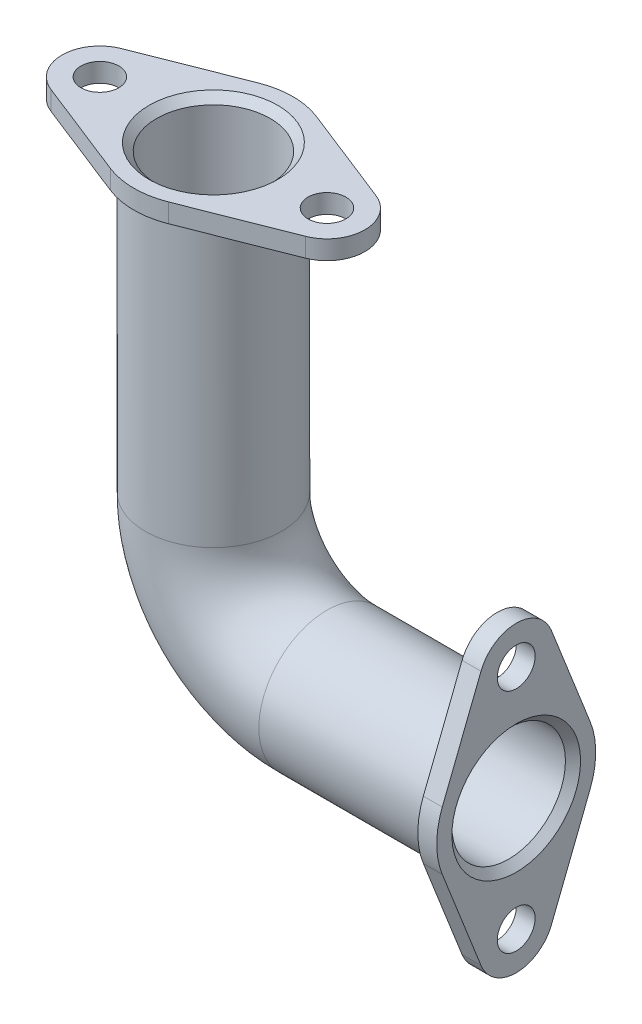
ISO-10303-21;
HEADER;
FILE_DESCRIPTION(('STEP AP214'),'2;1');
FILE_NAME('part.step','',(''),(''),'','','');
FILE_SCHEMA(('AUTOMOTIVE_DESIGN { 1 0 10303 214 1 1 1 1 }'));
ENDSEC;
DATA;
#1=APPLICATION_CONTEXT('core data for automotive mechanical design processes');
#2=APPLICATION_PROTOCOL_DEFINITION('international standard','automotive_design',2000,#1);
#3=PRODUCT_CONTEXT('',#1,'mechanical');
#4=PRODUCT('Part','Part','',(#3));
#5=PRODUCT_RELATED_PRODUCT_CATEGORY('part','',(#4));
#6=PRODUCT_DEFINITION_FORMATION('','',#4);
#7=PRODUCT_DEFINITION_CONTEXT('part definition',#1,'design');
#8=PRODUCT_DEFINITION('design','',#6,#7);
#9=PRODUCT_DEFINITION_SHAPE('','',#8);
#10=(LENGTH_UNIT() NAMED_UNIT(*) SI_UNIT(.MILLI.,.METRE.));
#11=(NAMED_UNIT(*) PLANE_ANGLE_UNIT() SI_UNIT($,.RADIAN.));
#12=(NAMED_UNIT(*) SI_UNIT($,.STERADIAN.) SOLID_ANGLE_UNIT());
#13=UNCERTAINTY_MEASURE_WITH_UNIT(LENGTH_MEASURE(1.E-05),#10,'distance_accuracy_value','');
#14=(GEOMETRIC_REPRESENTATION_CONTEXT(3) GLOBAL_UNCERTAINTY_ASSIGNED_CONTEXT((#13)) GLOBAL_UNIT_ASSIGNED_CONTEXT((#10,
#11,#12)) REPRESENTATION_CONTEXT('',''));
#15=CARTESIAN_POINT('',(0.,0.,0.));
#16=DIRECTION('',(0.,0.,1.));
#17=DIRECTION('',(1.,0.,0.));
#18=AXIS2_PLACEMENT_3D('',#15,#16,#17);
#19=CARTESIAN_POINT('',(150.,0.,0.));
#20=DIRECTION('',(-1.,0.,0.));
#21=DIRECTION('',(0.,-1.,0.));
#22=AXIS2_PLACEMENT_3D('',#19,#20,#21);
#23=CYLINDRICAL_SURFACE('',#22,36.);
#24=CARTESIAN_POINT('',(60.,0.,0.));
#25=DIRECTION('',(1.,0.,0.));
#26=DIRECTION('',(0.,0.,-1.));
#27=AXIS2_PLACEMENT_3D('',#24,#25,#26);
#28=CIRCLE('',#27,36.);
#29=CARTESIAN_POINT('',(60.,-36.,0.));
#30=VERTEX_POINT('',#29);
#31=EDGE_CURVE('E207',#30,#30,#28,.T.);
#32=ORIENTED_EDGE('',*,*,#31,.T.);
#33=EDGE_LOOP('',(#32));
#34=FACE_BOUND('',#33,.T.);
#35=CARTESIAN_POINT('',(150.,0.,0.));
#36=DIRECTION('',(1.,0.,0.));
#37=DIRECTION('',(0.,0.,-1.));
#38=AXIS2_PLACEMENT_3D('',#35,#36,#37);
#39=CIRCLE('',#38,36.);
#40=CARTESIAN_POINT('',(150.,0.,-36.));
#41=VERTEX_POINT('',#40);
#42=EDGE_CURVE('E203',#41,#41,#39,.T.);
#43=ORIENTED_EDGE('',*,*,#42,.F.);
#44=EDGE_LOOP('',(#43));
#45=FACE_BOUND('',#44,.T.);
#46=ADVANCED_FACE('F41',(#34,#45),#23,.T.);
#47=CARTESIAN_POINT('',(60.,60.,0.));
#48=DIRECTION('',(0.,0.,-1.));
#49=DIRECTION('',(-1.,0.,0.));
#50=AXIS2_PLACEMENT_3D('',#47,#48,#49);
#51=TOROIDAL_SURFACE('',#50,60.,36.);
#52=CARTESIAN_POINT('',(0.,60.,0.));
#53=DIRECTION('',(0.,-1.,0.));
#54=DIRECTION('',(0.,0.,-1.));
#55=AXIS2_PLACEMENT_3D('',#52,#53,#54);
#56=CIRCLE('',#55,36.);
#57=CARTESIAN_POINT('',(-36.,60.,0.));
#58=VERTEX_POINT('',#57);
#59=EDGE_CURVE('E211',#58,#58,#56,.T.);
#60=CARTESIAN_POINT('',(60.,60.,0.));
#61=DIRECTION('',(0.,0.,-1.));
#62=DIRECTION('',(-1.,0.,0.));
#63=AXIS2_PLACEMENT_3D('',#60,#61,#62);
#64=CIRCLE('',#63,96.);
#65=EDGE_CURVE('',#30,#58,#64,.T.);
#66=ORIENTED_EDGE('',*,*,#31,.F.);
#67=ORIENTED_EDGE('',*,*,#59,.T.);
#68=ORIENTED_EDGE('',*,*,#65,.T.);
#69=ORIENTED_EDGE('',*,*,#65,.F.);
#70=EDGE_LOOP('',(#66,#68,#67,#69));
#71=FACE_BOUND('',#70,.T.);
#72=ADVANCED_FACE('F244',(#71),#51,.T.);
#73=CARTESIAN_POINT('',(0.,60.,0.));
#74=DIRECTION('',(0.,1.,0.));
#75=DIRECTION('',(-1.,0.,0.));
#76=AXIS2_PLACEMENT_3D('',#73,#74,#75);
#77=CYLINDRICAL_SURFACE('',#76,36.);
#78=CARTESIAN_POINT('',(0.,210.,0.));
#79=DIRECTION('',(0.,-1.,0.));
#80=DIRECTION('',(0.,0.,-1.));
#81=AXIS2_PLACEMENT_3D('',#78,#79,#80);
#82=CIRCLE('',#81,36.);
#83=CARTESIAN_POINT('',(0.,210.,-36.));
#84=VERTEX_POINT('',#83);
#85=EDGE_CURVE('E194',#84,#84,#82,.T.);
#86=ORIENTED_EDGE('',*,*,#85,.T.);
#87=EDGE_LOOP('',(#86));
#88=FACE_BOUND('',#87,.T.);
#89=ORIENTED_EDGE('',*,*,#59,.F.);
#90=EDGE_LOOP('',(#89));
#91=FACE_BOUND('',#90,.T.);
#92=ADVANCED_FACE('F241',(#88,#91),#77,.T.);
#93=CARTESIAN_POINT('',(150.,0.,0.));
#94=DIRECTION('',(-1.,0.,0.));
#95=DIRECTION('',(0.,-1.,0.));
#96=AXIS2_PLACEMENT_3D('',#93,#94,#95);
#97=CYLINDRICAL_SURFACE('',#96,30.);
#98=CARTESIAN_POINT('',(156.,0.,0.));
#99=DIRECTION('',(1.,0.,0.));
#100=DIRECTION('',(0.,1.,0.));
#101=AXIS2_PLACEMENT_3D('',#98,#99,#100);
#102=CIRCLE('',#101,30.);
#103=CARTESIAN_POINT('',(156.,30.,0.));
#104=VERTEX_POINT('',#103);
#105=EDGE_CURVE('E215',#104,#104,#102,.T.);
#106=ORIENTED_EDGE('',*,*,#105,.T.);
#107=EDGE_LOOP('',(#106));
#108=FACE_BOUND('',#107,.T.);
#109=CARTESIAN_POINT('',(60.,0.,0.));
#110=DIRECTION('',(-1.,0.,0.));
#111=DIRECTION('',(0.,-1.,0.));
#112=AXIS2_PLACEMENT_3D('',#109,#110,#111);
#113=CIRCLE('',#112,30.);
#114=CARTESIAN_POINT('',(60.,-30.,0.));
#115=VERTEX_POINT('',#114);
#116=EDGE_CURVE('E195',#115,#115,#113,.F.);
#117=ORIENTED_EDGE('',*,*,#116,.F.);
#118=EDGE_LOOP('',(#117));
#119=FACE_BOUND('',#118,.T.);
#120=ADVANCED_FACE('F243',(#108,#119),#97,.F.);
#121=CARTESIAN_POINT('',(60.,60.,0.));
#122=DIRECTION('',(0.,0.,-1.));
#123=DIRECTION('',(-1.,0.,0.));
#124=AXIS2_PLACEMENT_3D('',#121,#122,#123);
#125=TOROIDAL_SURFACE('',#124,60.,30.);
#126=CARTESIAN_POINT('',(0.,60.,0.));
#127=DIRECTION('',(0.,-1.,0.));
#128=DIRECTION('',(0.,0.,-1.));
#129=AXIS2_PLACEMENT_3D('',#126,#127,#128);
#130=CIRCLE('',#129,30.);
#131=CARTESIAN_POINT('',(-30.,60.,0.));
#132=VERTEX_POINT('',#131);
#133=EDGE_CURVE('E199',#132,#132,#130,.T.);
#134=CARTESIAN_POINT('',(60.,60.,0.));
#135=DIRECTION('',(0.,0.,-1.));
#136=DIRECTION('',(-1.,0.,0.));
#137=AXIS2_PLACEMENT_3D('',#134,#135,#136);
#138=CIRCLE('',#137,90.);
#139=EDGE_CURVE('',#115,#132,#138,.T.);
#140=ORIENTED_EDGE('',*,*,#116,.T.);
#141=ORIENTED_EDGE('',*,*,#133,.F.);
#142=ORIENTED_EDGE('',*,*,#139,.T.);
#143=ORIENTED_EDGE('',*,*,#139,.F.);
#144=EDGE_LOOP('',(#140,#142,#141,#143));
#145=FACE_BOUND('',#144,.T.);
#146=ADVANCED_FACE('F251',(#145),#125,.F.);
#147=CARTESIAN_POINT('',(0.,60.,0.));
#148=DIRECTION('',(0.,1.,0.));
#149=DIRECTION('',(-1.,0.,0.));
#150=AXIS2_PLACEMENT_3D('',#147,#148,#149);
#151=CYLINDRICAL_SURFACE('',#150,30.);
#152=CARTESIAN_POINT('',(0.,216.,0.));
#153=DIRECTION('',(0.,1.,0.));
#154=DIRECTION('',(-1.,0.,0.));
#155=AXIS2_PLACEMENT_3D('',#152,#153,#154);
#156=CIRCLE('',#155,30.);
#157=CARTESIAN_POINT('',(-30.,216.,0.));
#158=VERTEX_POINT('',#157);
#159=EDGE_CURVE('E51',#158,#158,#156,.T.);
#160=ORIENTED_EDGE('',*,*,#159,.T.);
#161=EDGE_LOOP('',(#160));
#162=FACE_BOUND('',#161,.T.);
#163=ORIENTED_EDGE('',*,*,#133,.T.);
#164=EDGE_LOOP('',(#163));
#165=FACE_BOUND('',#164,.T.);
#166=ADVANCED_FACE('F229',(#162,#165),#151,.F.);
#167=CARTESIAN_POINT('',(-60.,220.,0.));
#168=DIRECTION('',(0.,1.,0.));
#169=DIRECTION('',(-1.,0.,0.));
#170=AXIS2_PLACEMENT_3D('',#167,#168,#169);
#171=PLANE('',#170);
#172=CARTESIAN_POINT('',(0.,220.,0.));
#173=DIRECTION('',(0.,1.,0.));
#174=DIRECTION('',(-1.,0.,0.));
#175=AXIS2_PLACEMENT_3D('',#172,#173,#174);
#176=CIRCLE('',#175,34.);
#177=CARTESIAN_POINT('',(-34.,220.,0.));
#178=VERTEX_POINT('',#177);
#179=EDGE_CURVE('E11',#178,#178,#176,.F.);
#180=ORIENTED_EDGE('',*,*,#179,.T.);
#181=EDGE_LOOP('',(#180));
#182=FACE_BOUND('',#181,.T.);
#183=CARTESIAN_POINT('',(60.,220.,0.));
#184=DIRECTION('',(0.,1.,0.));
#185=DIRECTION('',(-1.,0.,0.));
#186=AXIS2_PLACEMENT_3D('',#183,#184,#185);
#187=CIRCLE('',#186,9.99999999999999);
#188=CARTESIAN_POINT('',(50.,220.,0.));
#189=VERTEX_POINT('',#188);
#190=EDGE_CURVE('E154',#189,#189,#187,.T.);
#191=ORIENTED_EDGE('',*,*,#190,.F.);
#192=EDGE_LOOP('',(#191));
#193=FACE_BOUND('',#192,.T.);
#194=CARTESIAN_POINT('',(-60.,220.,0.));
#195=DIRECTION('',(0.,1.,0.));
#196=DIRECTION('',(-1.,0.,0.));
#197=AXIS2_PLACEMENT_3D('',#194,#195,#196);
#198=CIRCLE('',#197,20.);
#199=CARTESIAN_POINT('',(-67.3333333333333,220.,-18.6070476492705));
#200=VERTEX_POINT('',#199);
#201=CARTESIAN_POINT('',(-67.3333333333333,220.,18.6070476492705));
#202=VERTEX_POINT('',#201);
#203=EDGE_CURVE('E172',#200,#202,#198,.T.);
#204=ORIENTED_EDGE('',*,*,#203,.T.);
#205=DIRECTION('',(0.930352382463524,0.,0.366666666666667));
#206=VECTOR('',#205,1.);
#207=CARTESIAN_POINT('',(-67.3333333333333,220.,18.6070476492705));
#208=LINE('',#207,#206);
#209=CARTESIAN_POINT('',(-15.4,220.,39.074800063468));
#210=VERTEX_POINT('',#209);
#211=EDGE_CURVE('E104',#202,#210,#208,.T.);
#212=ORIENTED_EDGE('',*,*,#211,.T.);
#213=CARTESIAN_POINT('',(0.,220.,0.));
#214=DIRECTION('',(0.,1.,0.));
#215=DIRECTION('',(-1.,0.,0.));
#216=AXIS2_PLACEMENT_3D('',#213,#214,#215);
#217=CIRCLE('',#216,42.);
#218=CARTESIAN_POINT('',(15.4,220.,39.074800063468));
#219=VERTEX_POINT('',#218);
#220=EDGE_CURVE('E491',#210,#219,#217,.T.);
#221=ORIENTED_EDGE('',*,*,#220,.T.);
#222=DIRECTION('',(0.930352382463524,0.,-0.366666666666667));
#223=VECTOR('',#222,1.);
#224=CARTESIAN_POINT('',(15.4,220.,39.074800063468));
#225=LINE('',#224,#223);
#226=CARTESIAN_POINT('',(67.3333333333333,220.,18.6070476492705));
#227=VERTEX_POINT('',#226);
#228=EDGE_CURVE('E494',#219,#227,#225,.T.);
#229=ORIENTED_EDGE('',*,*,#228,.T.);
#230=CARTESIAN_POINT('',(60.,220.,0.));
#231=DIRECTION('',(0.,1.,0.));
#232=DIRECTION('',(-1.,0.,0.));
#233=AXIS2_PLACEMENT_3D('',#230,#231,#232);
#234=CIRCLE('',#233,20.);
#235=CARTESIAN_POINT('',(67.3333333333333,220.,-18.6070476492705));
#236=VERTEX_POINT('',#235);
#237=EDGE_CURVE('E127',#227,#236,#234,.T.);
#238=ORIENTED_EDGE('',*,*,#237,.T.);
#239=DIRECTION('',(-0.930352382463524,0.,-0.366666666666667));
#240=VECTOR('',#239,1.);
#241=CARTESIAN_POINT('',(67.3333333333333,220.,-18.6070476492705));
#242=LINE('',#241,#240);
#243=CARTESIAN_POINT('',(15.4,220.,-39.074800063468));
#244=VERTEX_POINT('',#243);
#245=EDGE_CURVE('E120',#236,#244,#242,.T.);
#246=ORIENTED_EDGE('',*,*,#245,.T.);
#247=CARTESIAN_POINT('',(0.,220.,0.));
#248=DIRECTION('',(0.,1.,0.));
#249=DIRECTION('',(-1.,0.,0.));
#250=AXIS2_PLACEMENT_3D('',#247,#248,#249);
#251=CIRCLE('',#250,42.);
#252=CARTESIAN_POINT('',(-15.4,220.,-39.074800063468));
#253=VERTEX_POINT('',#252);
#254=EDGE_CURVE('E125',#244,#253,#251,.T.);
#255=ORIENTED_EDGE('',*,*,#254,.T.);
#256=DIRECTION('',(-0.930352382463524,0.,0.366666666666667));
#257=VECTOR('',#256,1.);
#258=CARTESIAN_POINT('',(-67.3333333333333,220.,-18.6070476492705));
#259=LINE('',#258,#257);
#260=EDGE_CURVE('E59',#253,#200,#259,.T.);
#261=ORIENTED_EDGE('',*,*,#260,.T.);
#262=EDGE_LOOP('',(#204,#212,#221,#229,#238,#246,#255,#261));
#263=FACE_BOUND('',#262,.T.);
#264=CARTESIAN_POINT('',(-60.,220.,0.));
#265=DIRECTION('',(0.,1.,0.));
#266=DIRECTION('',(-1.,0.,0.));
#267=AXIS2_PLACEMENT_3D('',#264,#265,#266);
#268=CIRCLE('',#267,9.99999999999999);
#269=CARTESIAN_POINT('',(-70.,220.,0.));
#270=VERTEX_POINT('',#269);
#271=EDGE_CURVE('E473',#270,#270,#268,.T.);
#272=ORIENTED_EDGE('',*,*,#271,.F.);
#273=EDGE_LOOP('',(#272));
#274=FACE_BOUND('',#273,.T.);
#275=ADVANCED_FACE('F122',(#182,#193,#263,#274),#171,.T.);
#276=CARTESIAN_POINT('',(-60.,210.,0.));
#277=DIRECTION('',(0.,1.,0.));
#278=DIRECTION('',(-1.,0.,0.));
#279=AXIS2_PLACEMENT_3D('',#276,#277,#278);
#280=PLANE('',#279);
#281=ORIENTED_EDGE('',*,*,#85,.F.);
#282=EDGE_LOOP('',(#281));
#283=FACE_BOUND('',#282,.T.);
#284=CARTESIAN_POINT('',(-60.,210.,0.));
#285=DIRECTION('',(0.,1.,0.));
#286=DIRECTION('',(-1.,0.,0.));
#287=AXIS2_PLACEMENT_3D('',#284,#285,#286);
#288=CIRCLE('',#287,20.);
#289=CARTESIAN_POINT('',(-67.3333333333333,210.,-18.6070476492705));
#290=VERTEX_POINT('',#289);
#291=CARTESIAN_POINT('',(-67.3333333333333,210.,18.6070476492705));
#292=VERTEX_POINT('',#291);
#293=EDGE_CURVE('E149',#290,#292,#288,.T.);
#294=ORIENTED_EDGE('',*,*,#293,.F.);
#295=DIRECTION('',(-0.930352382463524,0.,0.366666666666667));
#296=VECTOR('',#295,1.);
#297=CARTESIAN_POINT('',(-67.3333333333333,210.,-18.6070476492705));
#298=LINE('',#297,#296);
#299=CARTESIAN_POINT('',(-15.4,210.,-39.074800063468));
#300=VERTEX_POINT('',#299);
#301=EDGE_CURVE('E95',#300,#290,#298,.T.);
#302=ORIENTED_EDGE('',*,*,#301,.F.);
#303=CARTESIAN_POINT('',(0.,210.,0.));
#304=DIRECTION('',(0.,1.,0.));
#305=DIRECTION('',(-1.,0.,0.));
#306=AXIS2_PLACEMENT_3D('',#303,#304,#305);
#307=CIRCLE('',#306,42.);
#308=CARTESIAN_POINT('',(15.4,210.,-39.074800063468));
#309=VERTEX_POINT('',#308);
#310=EDGE_CURVE('E89',#309,#300,#307,.T.);
#311=ORIENTED_EDGE('',*,*,#310,.F.);
#312=DIRECTION('',(-0.930352382463524,0.,-0.366666666666667));
#313=VECTOR('',#312,1.);
#314=CARTESIAN_POINT('',(67.3333333333333,210.,-18.6070476492705));
#315=LINE('',#314,#313);
#316=CARTESIAN_POINT('',(67.3333333333333,210.,-18.6070476492705));
#317=VERTEX_POINT('',#316);
#318=EDGE_CURVE('E136',#317,#309,#315,.T.);
#319=ORIENTED_EDGE('',*,*,#318,.F.);
#320=CARTESIAN_POINT('',(60.,210.,0.));
#321=DIRECTION('',(0.,1.,0.));
#322=DIRECTION('',(-1.,0.,0.));
#323=AXIS2_PLACEMENT_3D('',#320,#321,#322);
#324=CIRCLE('',#323,20.);
#325=CARTESIAN_POINT('',(67.3333333333333,210.,18.6070476492705));
#326=VERTEX_POINT('',#325);
#327=EDGE_CURVE('E163',#326,#317,#324,.T.);
#328=ORIENTED_EDGE('',*,*,#327,.F.);
#329=DIRECTION('',(0.930352382463524,0.,-0.366666666666667));
#330=VECTOR('',#329,1.);
#331=CARTESIAN_POINT('',(15.4,210.,39.074800063468));
#332=LINE('',#331,#330);
#333=CARTESIAN_POINT('',(15.4,210.,39.074800063468));
#334=VERTEX_POINT('',#333);
#335=EDGE_CURVE('E160',#334,#326,#332,.T.);
#336=ORIENTED_EDGE('',*,*,#335,.F.);
#337=CARTESIAN_POINT('',(0.,210.,0.));
#338=DIRECTION('',(0.,1.,0.));
#339=DIRECTION('',(-1.,0.,0.));
#340=AXIS2_PLACEMENT_3D('',#337,#338,#339);
#341=CIRCLE('',#340,42.);
#342=CARTESIAN_POINT('',(-15.4,210.,39.074800063468));
#343=VERTEX_POINT('',#342);
#344=EDGE_CURVE('E157',#343,#334,#341,.T.);
#345=ORIENTED_EDGE('',*,*,#344,.F.);
#346=DIRECTION('',(0.930352382463524,0.,0.366666666666667));
#347=VECTOR('',#346,1.);
#348=CARTESIAN_POINT('',(-67.3333333333333,210.,18.6070476492705));
#349=LINE('',#348,#347);
#350=EDGE_CURVE('E153',#292,#343,#349,.T.);
#351=ORIENTED_EDGE('',*,*,#350,.F.);
#352=EDGE_LOOP('',(#294,#302,#311,#319,#328,#336,#345,#351));
#353=FACE_BOUND('',#352,.T.);
#354=CARTESIAN_POINT('',(60.,210.,0.));
#355=DIRECTION('',(0.,1.,0.));
#356=DIRECTION('',(-1.,0.,0.));
#357=AXIS2_PLACEMENT_3D('',#354,#355,#356);
#358=CIRCLE('',#357,9.99999999999999);
#359=CARTESIAN_POINT('',(50.,210.,0.));
#360=VERTEX_POINT('',#359);
#361=EDGE_CURVE('E477',#360,#360,#358,.T.);
#362=ORIENTED_EDGE('',*,*,#361,.T.);
#363=EDGE_LOOP('',(#362));
#364=FACE_BOUND('',#363,.T.);
#365=CARTESIAN_POINT('',(-60.,210.,0.));
#366=DIRECTION('',(0.,1.,0.));
#367=DIRECTION('',(-1.,0.,0.));
#368=AXIS2_PLACEMENT_3D('',#365,#366,#367);
#369=CIRCLE('',#368,9.99999999999999);
#370=CARTESIAN_POINT('',(-70.,210.,0.));
#371=VERTEX_POINT('',#370);
#372=EDGE_CURVE('E472',#371,#371,#369,.T.);
#373=ORIENTED_EDGE('',*,*,#372,.T.);
#374=EDGE_LOOP('',(#373));
#375=FACE_BOUND('',#374,.T.);
#376=ADVANCED_FACE('F270',(#283,#353,#364,#375),#280,.F.);
#377=CARTESIAN_POINT('',(-60.,220.,0.));
#378=DIRECTION('',(0.,-1.,0.));
#379=DIRECTION('',(1.,0.,0.));
#380=AXIS2_PLACEMENT_3D('',#377,#378,#379);
#381=CYLINDRICAL_SURFACE('',#380,20.);
#382=ORIENTED_EDGE('',*,*,#293,.T.);
#383=DIRECTION('',(0.,-1.,0.));
#384=VECTOR('',#383,1.);
#385=CARTESIAN_POINT('',(-67.3333333333333,220.,18.6070476492705));
#386=LINE('',#385,#384);
#387=EDGE_CURVE('E191',#202,#292,#386,.T.);
#388=ORIENTED_EDGE('',*,*,#387,.F.);
#389=ORIENTED_EDGE('',*,*,#203,.F.);
#390=DIRECTION('',(0.,-1.,0.));
#391=VECTOR('',#390,1.);
#392=CARTESIAN_POINT('',(-67.3333333333333,220.,-18.6070476492705));
#393=LINE('',#392,#391);
#394=EDGE_CURVE('E145',#200,#290,#393,.T.);
#395=ORIENTED_EDGE('',*,*,#394,.T.);
#396=EDGE_LOOP('',(#382,#388,#389,#395));
#397=FACE_BOUND('',#396,.T.);
#398=ADVANCED_FACE('F266',(#397),#381,.T.);
#399=CARTESIAN_POINT('',(-67.3333333333333,220.,18.6070476492705));
#400=DIRECTION('',(0.366666666666667,0.,-0.930352382463524));
#401=DIRECTION('',(-0.930352382463524,0.,-0.366666666666667));
#402=AXIS2_PLACEMENT_3D('',#399,#400,#401);
#403=PLANE('',#402);
#404=ORIENTED_EDGE('',*,*,#350,.T.);
#405=DIRECTION('',(0.,-1.,0.));
#406=VECTOR('',#405,1.);
#407=CARTESIAN_POINT('',(-15.4,220.,39.074800063468));
#408=LINE('',#407,#406);
#409=EDGE_CURVE('E187',#210,#343,#408,.T.);
#410=ORIENTED_EDGE('',*,*,#409,.F.);
#411=ORIENTED_EDGE('',*,*,#211,.F.);
#412=ORIENTED_EDGE('',*,*,#387,.T.);
#413=EDGE_LOOP('',(#404,#410,#411,#412));
#414=FACE_BOUND('',#413,.T.);
#415=ADVANCED_FACE('F269',(#414),#403,.F.);
#416=CARTESIAN_POINT('',(0.,220.,0.));
#417=DIRECTION('',(0.,-1.,0.));
#418=DIRECTION('',(1.,0.,0.));
#419=AXIS2_PLACEMENT_3D('',#416,#417,#418);
#420=CYLINDRICAL_SURFACE('',#419,42.);
#421=ORIENTED_EDGE('',*,*,#344,.T.);
#422=DIRECTION('',(0.,-1.,0.));
#423=VECTOR('',#422,1.);
#424=CARTESIAN_POINT('',(15.4,220.,39.074800063468));
#425=LINE('',#424,#423);
#426=EDGE_CURVE('E183',#219,#334,#425,.T.);
#427=ORIENTED_EDGE('',*,*,#426,.F.);
#428=ORIENTED_EDGE('',*,*,#220,.F.);
#429=ORIENTED_EDGE('',*,*,#409,.T.);
#430=EDGE_LOOP('',(#421,#427,#428,#429));
#431=FACE_BOUND('',#430,.T.);
#432=ADVANCED_FACE('F274',(#431),#420,.T.);
#433=CARTESIAN_POINT('',(15.4,220.,39.074800063468));
#434=DIRECTION('',(-0.366666666666667,0.,-0.930352382463524));
#435=DIRECTION('',(-0.930352382463524,0.,0.366666666666667));
#436=AXIS2_PLACEMENT_3D('',#433,#434,#435);
#437=PLANE('',#436);
#438=ORIENTED_EDGE('',*,*,#335,.T.);
#439=DIRECTION('',(0.,-1.,0.));
#440=VECTOR('',#439,1.);
#441=CARTESIAN_POINT('',(67.3333333333333,220.,18.6070476492705));
#442=LINE('',#441,#440);
#443=EDGE_CURVE('E179',#227,#326,#442,.T.);
#444=ORIENTED_EDGE('',*,*,#443,.F.);
#445=ORIENTED_EDGE('',*,*,#228,.F.);
#446=ORIENTED_EDGE('',*,*,#426,.T.);
#447=EDGE_LOOP('',(#438,#444,#445,#446));
#448=FACE_BOUND('',#447,.T.);
#449=ADVANCED_FACE('F277',(#448),#437,.F.);
#450=CARTESIAN_POINT('',(60.,220.,0.));
#451=DIRECTION('',(0.,-1.,0.));
#452=DIRECTION('',(1.,0.,0.));
#453=AXIS2_PLACEMENT_3D('',#450,#451,#452);
#454=CYLINDRICAL_SURFACE('',#453,20.);
#455=ORIENTED_EDGE('',*,*,#327,.T.);
#456=DIRECTION('',(0.,-1.,0.));
#457=VECTOR('',#456,1.);
#458=CARTESIAN_POINT('',(67.3333333333333,220.,-18.6070476492705));
#459=LINE('',#458,#457);
#460=EDGE_CURVE('E138',#236,#317,#459,.T.);
#461=ORIENTED_EDGE('',*,*,#460,.F.);
#462=ORIENTED_EDGE('',*,*,#237,.F.);
#463=ORIENTED_EDGE('',*,*,#443,.T.);
#464=EDGE_LOOP('',(#455,#461,#462,#463));
#465=FACE_BOUND('',#464,.T.);
#466=ADVANCED_FACE('F281',(#465),#454,.T.);
#467=CARTESIAN_POINT('',(67.3333333333333,220.,-18.6070476492705));
#468=DIRECTION('',(-0.366666666666667,0.,0.930352382463524));
#469=DIRECTION('',(0.930352382463524,0.,0.366666666666667));
#470=AXIS2_PLACEMENT_3D('',#467,#468,#469);
#471=PLANE('',#470);
#472=ORIENTED_EDGE('',*,*,#318,.T.);
#473=DIRECTION('',(0.,-1.,0.));
#474=VECTOR('',#473,1.);
#475=CARTESIAN_POINT('',(15.4,220.,-39.074800063468));
#476=LINE('',#475,#474);
#477=EDGE_CURVE('E133',#244,#309,#476,.T.);
#478=ORIENTED_EDGE('',*,*,#477,.F.);
#479=ORIENTED_EDGE('',*,*,#245,.F.);
#480=ORIENTED_EDGE('',*,*,#460,.T.);
#481=EDGE_LOOP('',(#472,#478,#479,#480));
#482=FACE_BOUND('',#481,.T.);
#483=ADVANCED_FACE('F134',(#482),#471,.F.);
#484=CARTESIAN_POINT('',(0.,220.,0.));
#485=DIRECTION('',(0.,-1.,0.));
#486=DIRECTION('',(1.,0.,0.));
#487=AXIS2_PLACEMENT_3D('',#484,#485,#486);
#488=CYLINDRICAL_SURFACE('',#487,42.);
#489=ORIENTED_EDGE('',*,*,#310,.T.);
#490=DIRECTION('',(0.,-1.,0.));
#491=VECTOR('',#490,1.);
#492=CARTESIAN_POINT('',(-15.4,220.,-39.074800063468));
#493=LINE('',#492,#491);
#494=EDGE_CURVE('E139',#253,#300,#493,.T.);
#495=ORIENTED_EDGE('',*,*,#494,.F.);
#496=ORIENTED_EDGE('',*,*,#254,.F.);
#497=ORIENTED_EDGE('',*,*,#477,.T.);
#498=EDGE_LOOP('',(#489,#495,#496,#497));
#499=FACE_BOUND('',#498,.T.);
#500=ADVANCED_FACE('F141',(#499),#488,.T.);
#501=CARTESIAN_POINT('',(-67.3333333333333,220.,-18.6070476492705));
#502=DIRECTION('',(0.366666666666667,0.,0.930352382463524));
#503=DIRECTION('',(0.930352382463524,0.,-0.366666666666667));
#504=AXIS2_PLACEMENT_3D('',#501,#502,#503);
#505=PLANE('',#504);
#506=ORIENTED_EDGE('',*,*,#301,.T.);
#507=ORIENTED_EDGE('',*,*,#394,.F.);
#508=ORIENTED_EDGE('',*,*,#260,.F.);
#509=ORIENTED_EDGE('',*,*,#494,.T.);
#510=EDGE_LOOP('',(#506,#507,#508,#509));
#511=FACE_BOUND('',#510,.T.);
#512=ADVANCED_FACE('F290',(#511),#505,.F.);
#513=CARTESIAN_POINT('',(60.,220.,0.));
#514=DIRECTION('',(0.,-1.,0.));
#515=DIRECTION('',(1.,0.,0.));
#516=AXIS2_PLACEMENT_3D('',#513,#514,#515);
#517=CYLINDRICAL_SURFACE('',#516,9.99999999999999);
#518=ORIENTED_EDGE('',*,*,#190,.T.);
#519=EDGE_LOOP('',(#518));
#520=FACE_BOUND('',#519,.T.);
#521=ORIENTED_EDGE('',*,*,#361,.F.);
#522=EDGE_LOOP('',(#521));
#523=FACE_BOUND('',#522,.T.);
#524=ADVANCED_FACE('F293',(#520,#523),#517,.F.);
#525=CARTESIAN_POINT('',(-60.,220.,0.));
#526=DIRECTION('',(0.,-1.,0.));
#527=DIRECTION('',(1.,0.,0.));
#528=AXIS2_PLACEMENT_3D('',#525,#526,#527);
#529=CYLINDRICAL_SURFACE('',#528,9.99999999999999);
#530=ORIENTED_EDGE('',*,*,#271,.T.);
#531=EDGE_LOOP('',(#530));
#532=FACE_BOUND('',#531,.T.);
#533=ORIENTED_EDGE('',*,*,#372,.F.);
#534=EDGE_LOOP('',(#533));
#535=FACE_BOUND('',#534,.T.);
#536=ADVANCED_FACE('F302',(#532,#535),#529,.F.);
#537=CARTESIAN_POINT('',(160.,59.9999999999595,6.96738850780587E-05));
#538=DIRECTION('',(1.,0.,0.));
#539=DIRECTION('',(0.,0.,-1.));
#540=AXIS2_PLACEMENT_3D('',#537,#538,#539);
#541=PLANE('',#540);
#542=CARTESIAN_POINT('',(160.,0.,0.));
#543=DIRECTION('',(1.,0.,0.));
#544=DIRECTION('',(0.,0.,-1.));
#545=AXIS2_PLACEMENT_3D('',#542,#543,#544);
#546=CIRCLE('',#545,34.0000000000001);
#547=CARTESIAN_POINT('',(160.,0.,-34.0000000000001));
#548=VERTEX_POINT('',#547);
#549=EDGE_CURVE('E222',#548,#548,#546,.F.);
#550=ORIENTED_EDGE('',*,*,#549,.T.);
#551=EDGE_LOOP('',(#550));
#552=FACE_BOUND('',#551,.T.);
#553=CARTESIAN_POINT('',(160.,-60.,-2.21819090873154E-11));
#554=DIRECTION('',(1.,0.,0.));
#555=DIRECTION('',(0.,0.,-1.));
#556=AXIS2_PLACEMENT_3D('',#553,#554,#555);
#557=CIRCLE('',#556,9.99999999997879);
#558=CARTESIAN_POINT('',(160.,-60.,-10.000000000001));
#559=VERTEX_POINT('',#558);
#560=EDGE_CURVE('E369',#559,#559,#557,.T.);
#561=ORIENTED_EDGE('',*,*,#560,.F.);
#562=EDGE_LOOP('',(#561));
#563=FACE_BOUND('',#562,.T.);
#564=CARTESIAN_POINT('',(160.,59.9999999999595,6.96738850780587E-05));
#565=DIRECTION('',(1.,0.,0.));
#566=DIRECTION('',(0.,0.,-1.));
#567=AXIS2_PLACEMENT_3D('',#564,#565,#566);
#568=CIRCLE('',#567,20.);
#569=CARTESIAN_POINT('',(160.,67.3333549403763,-18.6069694596758));
#570=VERTEX_POINT('',#569);
#571=CARTESIAN_POINT('',(160.,67.3333117261996,18.6071258388401));
#572=VERTEX_POINT('',#571);
#573=EDGE_CURVE('E377',#570,#572,#568,.T.);
#574=ORIENTED_EDGE('',*,*,#573,.T.);
#575=DIRECTION('',(0.,-0.93035280824775,0.366665586312003));
#576=VECTOR('',#575,1.);
#577=CARTESIAN_POINT('',(160.,67.3333117261996,18.6071258388401));
#578=LINE('',#577,#576);
#579=CARTESIAN_POINT('',(160.,15.3999546251041,39.0748179464055));
#580=VERTEX_POINT('',#579);
#581=EDGE_CURVE('E381',#572,#580,#578,.T.);
#582=ORIENTED_EDGE('',*,*,#581,.T.);
#583=CARTESIAN_POINT('',(160.,0.,0.));
#584=DIRECTION('',(1.,0.,0.));
#585=DIRECTION('',(0.,0.,-1.));
#586=AXIS2_PLACEMENT_3D('',#583,#584,#585);
#587=CIRCLE('',#586,42.);
#588=CARTESIAN_POINT('',(160.,-15.4000000000144,39.0748000634623));
#589=VERTEX_POINT('',#588);
#590=EDGE_CURVE('E386',#580,#589,#587,.T.);
#591=ORIENTED_EDGE('',*,*,#590,.T.);
#592=DIRECTION('',(0.,-0.930352382463389,-0.366666666667011));
#593=VECTOR('',#592,1.);
#594=CARTESIAN_POINT('',(160.,-67.3333333333402,18.6070476492456));
#595=LINE('',#594,#593);
#596=CARTESIAN_POINT('',(160.,-67.3333333333402,18.6070476492456));
#597=VERTEX_POINT('',#596);
#598=EDGE_CURVE('E390',#589,#597,#595,.T.);
#599=ORIENTED_EDGE('',*,*,#598,.T.);
#600=CARTESIAN_POINT('',(160.,-60.,-2.21819090873154E-11));
#601=DIRECTION('',(1.,0.,0.));
#602=DIRECTION('',(0.,0.,-1.));
#603=AXIS2_PLACEMENT_3D('',#600,#601,#602);
#604=CIRCLE('',#603,20.);
#605=CARTESIAN_POINT('',(160.,-67.3333333333265,-18.6070476492953));
#606=VERTEX_POINT('',#605);
#607=EDGE_CURVE('E394',#597,#606,#604,.T.);
#608=ORIENTED_EDGE('',*,*,#607,.T.);
#609=DIRECTION('',(0.,0.930352382463659,-0.366666666666323));
#610=VECTOR('',#609,1.);
#611=CARTESIAN_POINT('',(160.,-67.3333333333265,-18.6070476492953));
#612=LINE('',#611,#610);
#613=CARTESIAN_POINT('',(160.,-15.3999999999855,-39.0748000634737));
#614=VERTEX_POINT('',#613);
#615=EDGE_CURVE('E398',#606,#614,#612,.T.);
#616=ORIENTED_EDGE('',*,*,#615,.T.);
#617=CARTESIAN_POINT('',(160.,0.,0.));
#618=DIRECTION('',(1.,0.,0.));
#619=DIRECTION('',(0.,0.,-1.));
#620=AXIS2_PLACEMENT_3D('',#617,#618,#619);
#621=CIRCLE('',#620,42.);
#622=CARTESIAN_POINT('',(160.,15.4000453748751,-39.0747821804778));
#623=VERTEX_POINT('',#622);
#624=EDGE_CURVE('E402',#614,#623,#621,.T.);
#625=ORIENTED_EDGE('',*,*,#624,.T.);
#626=DIRECTION('',(0.,0.930351956678044,0.366667747020836));
#627=VECTOR('',#626,1.);
#628=CARTESIAN_POINT('',(160.,67.3333549403763,-18.6069694596758));
#629=LINE('',#628,#627);
#630=EDGE_CURVE('E406',#623,#570,#629,.T.);
#631=ORIENTED_EDGE('',*,*,#630,.T.);
#632=EDGE_LOOP('',(#574,#582,#591,#599,#608,#616,#625,#631));
#633=FACE_BOUND('',#632,.T.);
#634=CARTESIAN_POINT('',(160.,59.9999999999595,6.96738850780587E-05));
#635=DIRECTION('',(1.,0.,0.));
#636=DIRECTION('',(0.,0.,-1.));
#637=AXIS2_PLACEMENT_3D('',#634,#635,#636);
#638=CIRCLE('',#637,10.);
#639=CARTESIAN_POINT('',(160.,59.9999999999595,-9.99993032611492));
#640=VERTEX_POINT('',#639);
#641=EDGE_CURVE('E358',#640,#640,#638,.T.);
#642=ORIENTED_EDGE('',*,*,#641,.F.);
#643=EDGE_LOOP('',(#642));
#644=FACE_BOUND('',#643,.T.);
#645=ADVANCED_FACE('F306',(#552,#563,#633,#644),#541,.T.);
#646=CARTESIAN_POINT('',(150.,59.9999999999595,6.96738850780587E-05));
#647=DIRECTION('',(1.,0.,0.));
#648=DIRECTION('',(0.,0.,-1.));
#649=AXIS2_PLACEMENT_3D('',#646,#647,#648);
#650=PLANE('',#649);
#651=ORIENTED_EDGE('',*,*,#42,.T.);
#652=EDGE_LOOP('',(#651));
#653=FACE_BOUND('',#652,.T.);
#654=CARTESIAN_POINT('',(150.,59.9999999999595,6.96738850780587E-05));
#655=DIRECTION('',(1.,0.,0.));
#656=DIRECTION('',(0.,0.,-1.));
#657=AXIS2_PLACEMENT_3D('',#654,#655,#656);
#658=CIRCLE('',#657,20.);
#659=CARTESIAN_POINT('',(150.,67.3333549403763,-18.6069694596758));
#660=VERTEX_POINT('',#659);
#661=CARTESIAN_POINT('',(150.,67.3333117261996,18.6071258388401));
#662=VERTEX_POINT('',#661);
#663=EDGE_CURVE('E373',#660,#662,#658,.T.);
#664=ORIENTED_EDGE('',*,*,#663,.F.);
#665=DIRECTION('',(0.,0.930351956678044,0.366667747020836));
#666=VECTOR('',#665,1.);
#667=CARTESIAN_POINT('',(150.,67.3333549403763,-18.6069694596758));
#668=LINE('',#667,#666);
#669=CARTESIAN_POINT('',(150.,15.4000453748751,-39.0747821804778));
#670=VERTEX_POINT('',#669);
#671=EDGE_CURVE('E382',#670,#660,#668,.T.);
#672=ORIENTED_EDGE('',*,*,#671,.F.);
#673=CARTESIAN_POINT('',(150.,0.,0.));
#674=DIRECTION('',(1.,0.,0.));
#675=DIRECTION('',(0.,0.,-1.));
#676=AXIS2_PLACEMENT_3D('',#673,#674,#675);
#677=CIRCLE('',#676,42.);
#678=CARTESIAN_POINT('',(150.,-15.3999999999855,-39.0748000634737));
#679=VERTEX_POINT('',#678);
#680=EDGE_CURVE('E434',#679,#670,#677,.T.);
#681=ORIENTED_EDGE('',*,*,#680,.F.);
#682=DIRECTION('',(0.,0.930352382463659,-0.366666666666323));
#683=VECTOR('',#682,1.);
#684=CARTESIAN_POINT('',(150.,-67.3333333333265,-18.6070476492953));
#685=LINE('',#684,#683);
#686=CARTESIAN_POINT('',(150.,-67.3333333333265,-18.6070476492953));
#687=VERTEX_POINT('',#686);
#688=EDGE_CURVE('E430',#687,#679,#685,.T.);
#689=ORIENTED_EDGE('',*,*,#688,.F.);
#690=CARTESIAN_POINT('',(150.,-60.,-2.21819090873154E-11));
#691=DIRECTION('',(1.,0.,0.));
#692=DIRECTION('',(0.,0.,-1.));
#693=AXIS2_PLACEMENT_3D('',#690,#691,#692);
#694=CIRCLE('',#693,20.);
#695=CARTESIAN_POINT('',(150.,-67.3333333333402,18.6070476492456));
#696=VERTEX_POINT('',#695);
#697=EDGE_CURVE('E426',#696,#687,#694,.T.);
#698=ORIENTED_EDGE('',*,*,#697,.F.);
#699=DIRECTION('',(0.,-0.930352382463389,-0.366666666667011));
#700=VECTOR('',#699,1.);
#701=CARTESIAN_POINT('',(150.,-67.3333333333402,18.6070476492456));
#702=LINE('',#701,#700);
#703=CARTESIAN_POINT('',(150.,-15.4000000000144,39.0748000634623));
#704=VERTEX_POINT('',#703);
#705=EDGE_CURVE('E422',#704,#696,#702,.T.);
#706=ORIENTED_EDGE('',*,*,#705,.F.);
#707=CARTESIAN_POINT('',(150.,0.,0.));
#708=DIRECTION('',(1.,0.,0.));
#709=DIRECTION('',(0.,0.,-1.));
#710=AXIS2_PLACEMENT_3D('',#707,#708,#709);
#711=CIRCLE('',#710,42.);
#712=CARTESIAN_POINT('',(150.,15.3999546251041,39.0748179464055));
#713=VERTEX_POINT('',#712);
#714=EDGE_CURVE('E418',#713,#704,#711,.T.);
#715=ORIENTED_EDGE('',*,*,#714,.F.);
#716=DIRECTION('',(0.,-0.93035280824775,0.366665586312003));
#717=VECTOR('',#716,1.);
#718=CARTESIAN_POINT('',(150.,67.3333117261996,18.6071258388401));
#719=LINE('',#718,#717);
#720=EDGE_CURVE('E414',#662,#713,#719,.T.);
#721=ORIENTED_EDGE('',*,*,#720,.F.);
#722=EDGE_LOOP('',(#664,#672,#681,#689,#698,#706,#715,#721));
#723=FACE_BOUND('',#722,.T.);
#724=CARTESIAN_POINT('',(150.,-60.,-2.21819090873154E-11));
#725=DIRECTION('',(1.,0.,0.));
#726=DIRECTION('',(0.,0.,-1.));
#727=AXIS2_PLACEMENT_3D('',#724,#725,#726);
#728=CIRCLE('',#727,9.99999999997879);
#729=CARTESIAN_POINT('',(150.,-60.,-10.000000000001));
#730=VERTEX_POINT('',#729);
#731=EDGE_CURVE('E366',#730,#730,#728,.T.);
#732=ORIENTED_EDGE('',*,*,#731,.T.);
#733=EDGE_LOOP('',(#732));
#734=FACE_BOUND('',#733,.T.);
#735=CARTESIAN_POINT('',(150.,59.9999999999595,6.96738850780587E-05));
#736=DIRECTION('',(1.,0.,0.));
#737=DIRECTION('',(0.,0.,-1.));
#738=AXIS2_PLACEMENT_3D('',#735,#736,#737);
#739=CIRCLE('',#738,10.);
#740=CARTESIAN_POINT('',(150.,59.9999999999595,-9.99993032611492));
#741=VERTEX_POINT('',#740);
#742=EDGE_CURVE('E361',#741,#741,#739,.T.);
#743=ORIENTED_EDGE('',*,*,#742,.T.);
#744=EDGE_LOOP('',(#743));
#745=FACE_BOUND('',#744,.T.);
#746=ADVANCED_FACE('F312',(#653,#723,#734,#745),#650,.F.);
#747=CARTESIAN_POINT('',(160.,59.9999999999595,6.96738850780587E-05));
#748=DIRECTION('',(-1.,0.,0.));
#749=DIRECTION('',(0.,0.,1.));
#750=AXIS2_PLACEMENT_3D('',#747,#748,#749);
#751=CYLINDRICAL_SURFACE('',#750,20.);
#752=ORIENTED_EDGE('',*,*,#663,.T.);
#753=DIRECTION('',(-1.,0.,0.));
#754=VECTOR('',#753,1.);
#755=CARTESIAN_POINT('',(160.,67.3333117261996,18.6071258388401));
#756=LINE('',#755,#754);
#757=EDGE_CURVE('E468',#572,#662,#756,.T.);
#758=ORIENTED_EDGE('',*,*,#757,.F.);
#759=ORIENTED_EDGE('',*,*,#573,.F.);
#760=DIRECTION('',(-1.,0.,0.));
#761=VECTOR('',#760,1.);
#762=CARTESIAN_POINT('',(160.,67.3333549403763,-18.6069694596758));
#763=LINE('',#762,#761);
#764=EDGE_CURVE('E410',#570,#660,#763,.T.);
#765=ORIENTED_EDGE('',*,*,#764,.T.);
#766=EDGE_LOOP('',(#752,#758,#759,#765));
#767=FACE_BOUND('',#766,.T.);
#768=ADVANCED_FACE('F308',(#767),#751,.T.);
#769=CARTESIAN_POINT('',(160.,67.3333117261996,18.6071258388401));
#770=DIRECTION('',(0.,-0.366665586312003,-0.93035280824775));
#771=DIRECTION('',(0.,0.93035280824775,-0.366665586312003));
#772=AXIS2_PLACEMENT_3D('',#769,#770,#771);
#773=PLANE('',#772);
#774=ORIENTED_EDGE('',*,*,#720,.T.);
#775=DIRECTION('',(-1.,0.,0.));
#776=VECTOR('',#775,1.);
#777=CARTESIAN_POINT('',(160.,15.3999546251041,39.0748179464055));
#778=LINE('',#777,#776);
#779=EDGE_CURVE('E464',#580,#713,#778,.T.);
#780=ORIENTED_EDGE('',*,*,#779,.F.);
#781=ORIENTED_EDGE('',*,*,#581,.F.);
#782=ORIENTED_EDGE('',*,*,#757,.T.);
#783=EDGE_LOOP('',(#774,#780,#781,#782));
#784=FACE_BOUND('',#783,.T.);
#785=ADVANCED_FACE('F311',(#784),#773,.F.);
#786=CARTESIAN_POINT('',(160.,0.,0.));
#787=DIRECTION('',(-1.,0.,0.));
#788=DIRECTION('',(0.,0.,1.));
#789=AXIS2_PLACEMENT_3D('',#786,#787,#788);
#790=CYLINDRICAL_SURFACE('',#789,42.);
#791=ORIENTED_EDGE('',*,*,#714,.T.);
#792=DIRECTION('',(-1.,0.,0.));
#793=VECTOR('',#792,1.);
#794=CARTESIAN_POINT('',(160.,-15.4000000000144,39.0748000634623));
#795=LINE('',#794,#793);
#796=EDGE_CURVE('E460',#589,#704,#795,.T.);
#797=ORIENTED_EDGE('',*,*,#796,.F.);
#798=ORIENTED_EDGE('',*,*,#590,.F.);
#799=ORIENTED_EDGE('',*,*,#779,.T.);
#800=EDGE_LOOP('',(#791,#797,#798,#799));
#801=FACE_BOUND('',#800,.T.);
#802=ADVANCED_FACE('F316',(#801),#790,.T.);
#803=CARTESIAN_POINT('',(160.,-67.3333333333402,18.6070476492456));
#804=DIRECTION('',(0.,0.366666666667011,-0.930352382463389));
#805=DIRECTION('',(0.,0.930352382463389,0.366666666667011));
#806=AXIS2_PLACEMENT_3D('',#803,#804,#805);
#807=PLANE('',#806);
#808=ORIENTED_EDGE('',*,*,#705,.T.);
#809=DIRECTION('',(-1.,0.,0.));
#810=VECTOR('',#809,1.);
#811=CARTESIAN_POINT('',(160.,-67.3333333333402,18.6070476492456));
#812=LINE('',#811,#810);
#813=EDGE_CURVE('E456',#597,#696,#812,.T.);
#814=ORIENTED_EDGE('',*,*,#813,.F.);
#815=ORIENTED_EDGE('',*,*,#598,.F.);
#816=ORIENTED_EDGE('',*,*,#796,.T.);
#817=EDGE_LOOP('',(#808,#814,#815,#816));
#818=FACE_BOUND('',#817,.T.);
#819=ADVANCED_FACE('F320',(#818),#807,.F.);
#820=CARTESIAN_POINT('',(160.,-60.,-2.21819090873154E-11));
#821=DIRECTION('',(-1.,0.,0.));
#822=DIRECTION('',(0.,0.,1.));
#823=AXIS2_PLACEMENT_3D('',#820,#821,#822);
#824=CYLINDRICAL_SURFACE('',#823,20.);
#825=ORIENTED_EDGE('',*,*,#697,.T.);
#826=DIRECTION('',(-1.,0.,0.));
#827=VECTOR('',#826,1.);
#828=CARTESIAN_POINT('',(160.,-67.3333333333265,-18.6070476492953));
#829=LINE('',#828,#827);
#830=EDGE_CURVE('E452',#606,#687,#829,.T.);
#831=ORIENTED_EDGE('',*,*,#830,.F.);
#832=ORIENTED_EDGE('',*,*,#607,.F.);
#833=ORIENTED_EDGE('',*,*,#813,.T.);
#834=EDGE_LOOP('',(#825,#831,#832,#833));
#835=FACE_BOUND('',#834,.T.);
#836=ADVANCED_FACE('F324',(#835),#824,.T.);
#837=CARTESIAN_POINT('',(160.,-67.3333333333265,-18.6070476492953));
#838=DIRECTION('',(0.,0.366666666666323,0.93035238246366));
#839=DIRECTION('',(0.,-0.93035238246366,0.366666666666323));
#840=AXIS2_PLACEMENT_3D('',#837,#838,#839);
#841=PLANE('',#840);
#842=ORIENTED_EDGE('',*,*,#688,.T.);
#843=DIRECTION('',(-1.,0.,0.));
#844=VECTOR('',#843,1.);
#845=CARTESIAN_POINT('',(160.,-15.3999999999855,-39.0748000634737));
#846=LINE('',#845,#844);
#847=EDGE_CURVE('E448',#614,#679,#846,.T.);
#848=ORIENTED_EDGE('',*,*,#847,.F.);
#849=ORIENTED_EDGE('',*,*,#615,.F.);
#850=ORIENTED_EDGE('',*,*,#830,.T.);
#851=EDGE_LOOP('',(#842,#848,#849,#850));
#852=FACE_BOUND('',#851,.T.);
#853=ADVANCED_FACE('F328',(#852),#841,.F.);
#854=CARTESIAN_POINT('',(160.,0.,0.));
#855=DIRECTION('',(-1.,0.,0.));
#856=DIRECTION('',(0.,0.,1.));
#857=AXIS2_PLACEMENT_3D('',#854,#855,#856);
#858=CYLINDRICAL_SURFACE('',#857,42.);
#859=ORIENTED_EDGE('',*,*,#680,.T.);
#860=DIRECTION('',(-1.,0.,0.));
#861=VECTOR('',#860,1.);
#862=CARTESIAN_POINT('',(160.,15.4000453748751,-39.0747821804778));
#863=LINE('',#862,#861);
#864=EDGE_CURVE('E444',#623,#670,#863,.T.);
#865=ORIENTED_EDGE('',*,*,#864,.F.);
#866=ORIENTED_EDGE('',*,*,#624,.F.);
#867=ORIENTED_EDGE('',*,*,#847,.T.);
#868=EDGE_LOOP('',(#859,#865,#866,#867));
#869=FACE_BOUND('',#868,.T.);
#870=ADVANCED_FACE('F332',(#869),#858,.T.);
#871=CARTESIAN_POINT('',(160.,67.3333549403763,-18.6069694596758));
#872=DIRECTION('',(0.,-0.366667747020836,0.930351956678044));
#873=DIRECTION('',(0.,-0.930351956678044,-0.366667747020836));
#874=AXIS2_PLACEMENT_3D('',#871,#872,#873);
#875=PLANE('',#874);
#876=ORIENTED_EDGE('',*,*,#671,.T.);
#877=ORIENTED_EDGE('',*,*,#764,.F.);
#878=ORIENTED_EDGE('',*,*,#630,.F.);
#879=ORIENTED_EDGE('',*,*,#864,.T.);
#880=EDGE_LOOP('',(#876,#877,#878,#879));
#881=FACE_BOUND('',#880,.T.);
#882=ADVANCED_FACE('F336',(#881),#875,.F.);
#883=CARTESIAN_POINT('',(160.,-60.,-2.21819090873154E-11));
#884=DIRECTION('',(-1.,0.,0.));
#885=DIRECTION('',(0.,0.,1.));
#886=AXIS2_PLACEMENT_3D('',#883,#884,#885);
#887=CYLINDRICAL_SURFACE('',#886,9.99999999997879);
#888=ORIENTED_EDGE('',*,*,#560,.T.);
#889=EDGE_LOOP('',(#888));
#890=FACE_BOUND('',#889,.T.);
#891=ORIENTED_EDGE('',*,*,#731,.F.);
#892=EDGE_LOOP('',(#891));
#893=FACE_BOUND('',#892,.T.);
#894=ADVANCED_FACE('F340',(#890,#893),#887,.F.);
#895=CARTESIAN_POINT('',(160.,59.9999999999595,6.96738850780587E-05));
#896=DIRECTION('',(-1.,0.,0.));
#897=DIRECTION('',(0.,0.,1.));
#898=AXIS2_PLACEMENT_3D('',#895,#896,#897);
#899=CYLINDRICAL_SURFACE('',#898,10.);
#900=ORIENTED_EDGE('',*,*,#641,.T.);
#901=EDGE_LOOP('',(#900));
#902=FACE_BOUND('',#901,.T.);
#903=ORIENTED_EDGE('',*,*,#742,.F.);
#904=EDGE_LOOP('',(#903));
#905=FACE_BOUND('',#904,.T.);
#906=ADVANCED_FACE('F238',(#902,#905),#899,.F.);
#907=CARTESIAN_POINT('',(156.,0.,0.));
#908=DIRECTION('',(1.,0.,0.));
#909=DIRECTION('',(0.,1.,0.));
#910=AXIS2_PLACEMENT_3D('',#907,#908,#909);
#911=CONICAL_SURFACE('',#910,30.,0.785398163397452);
#912=ORIENTED_EDGE('',*,*,#549,.F.);
#913=EDGE_LOOP('',(#912));
#914=FACE_BOUND('',#913,.T.);
#915=ORIENTED_EDGE('',*,*,#105,.F.);
#916=EDGE_LOOP('',(#915));
#917=FACE_BOUND('',#916,.T.);
#918=ADVANCED_FACE('F233',(#914,#917),#911,.F.);
#919=CARTESIAN_POINT('',(0.,216.,0.));
#920=DIRECTION('',(0.,1.,0.));
#921=DIRECTION('',(-1.,0.,0.));
#922=AXIS2_PLACEMENT_3D('',#919,#920,#921);
#923=CONICAL_SURFACE('',#922,30.,0.785398163397452);
#924=ORIENTED_EDGE('',*,*,#179,.F.);
#925=EDGE_LOOP('',(#924));
#926=FACE_BOUND('',#925,.T.);
#927=ORIENTED_EDGE('',*,*,#159,.F.);
#928=EDGE_LOOP('',(#927));
#929=FACE_BOUND('',#928,.T.);
#930=ADVANCED_FACE('F43',(#926,#929),#923,.F.);
#931=CLOSED_SHELL('',(#46,#72,#92,#120,#146,#166,#275,#376,#398,#415,#432,#449,#466,#483,#500,
#512,#524,#536,#645,#746,#768,#785,#802,#819,#836,#853,#870,#882,#894,#906,#918,#930));
#932=MANIFOLD_SOLID_BREP('B2',#931);
#933=ADVANCED_BREP_SHAPE_REPRESENTATION('',(#18,#932),#14);
#934=SHAPE_DEFINITION_REPRESENTATION(#9,#933);
ENDSEC;
END-ISO-10303-21;
